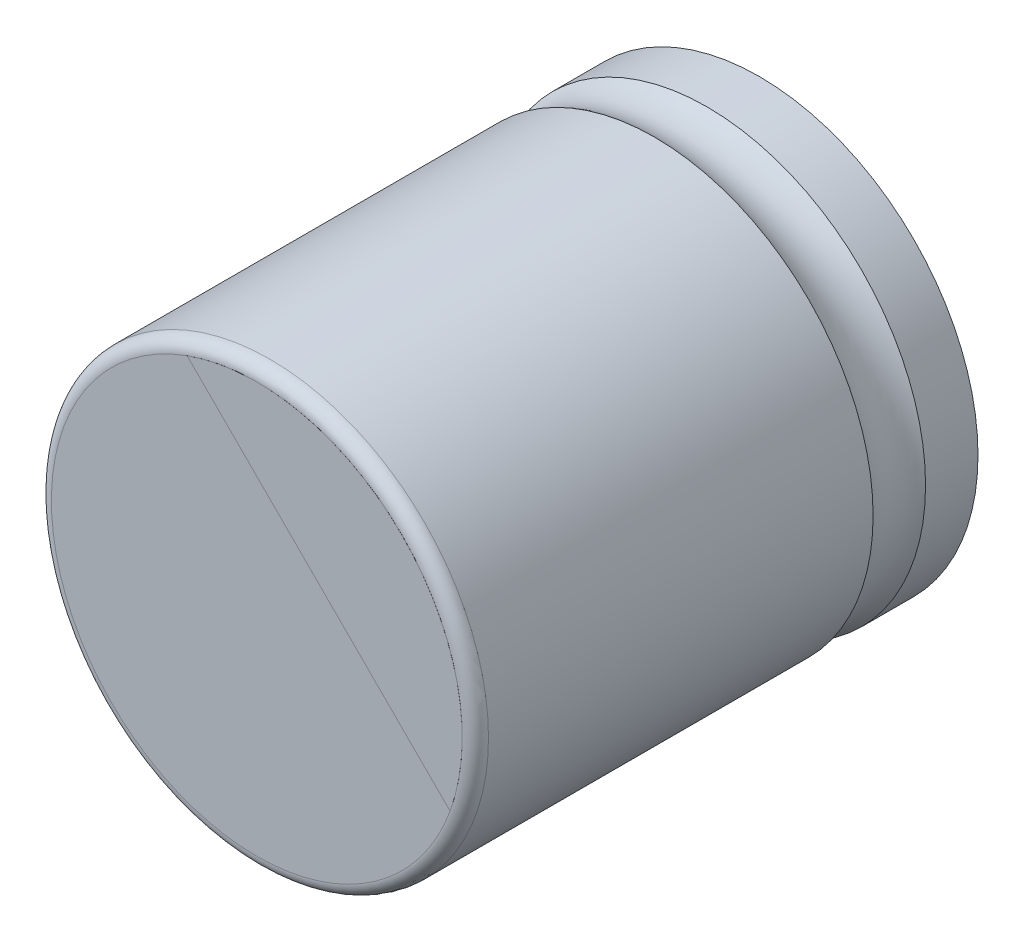
ISO-10303-21;
HEADER;
FILE_DESCRIPTION(('STEP AP214'),'2;1');
FILE_NAME('part.step','',(''),(''),'','','');
FILE_SCHEMA(('AUTOMOTIVE_DESIGN { 1 0 10303 214 1 1 1 1 }'));
ENDSEC;
DATA;
#1=APPLICATION_CONTEXT('core data for automotive mechanical design processes');
#2=APPLICATION_PROTOCOL_DEFINITION('international standard','automotive_design',2000,#1);
#3=PRODUCT_CONTEXT('',#1,'mechanical');
#4=PRODUCT('Part','Part','',(#3));
#5=PRODUCT_RELATED_PRODUCT_CATEGORY('part','',(#4));
#6=PRODUCT_DEFINITION_FORMATION('','',#4);
#7=PRODUCT_DEFINITION_CONTEXT('part definition',#1,'design');
#8=PRODUCT_DEFINITION('design','',#6,#7);
#9=PRODUCT_DEFINITION_SHAPE('','',#8);
#10=(LENGTH_UNIT() NAMED_UNIT(*) SI_UNIT(.MILLI.,.METRE.));
#11=(NAMED_UNIT(*) PLANE_ANGLE_UNIT() SI_UNIT($,.RADIAN.));
#12=(NAMED_UNIT(*) SI_UNIT($,.STERADIAN.) SOLID_ANGLE_UNIT());
#13=UNCERTAINTY_MEASURE_WITH_UNIT(LENGTH_MEASURE(1.E-05),#10,'distance_accuracy_value','');
#14=(GEOMETRIC_REPRESENTATION_CONTEXT(3) GLOBAL_UNCERTAINTY_ASSIGNED_CONTEXT((#13)) GLOBAL_UNIT_ASSIGNED_CONTEXT((#10,
#11,#12)) REPRESENTATION_CONTEXT('',''));
#15=CARTESIAN_POINT('',(0.,0.,0.));
#16=DIRECTION('',(0.,0.,1.));
#17=DIRECTION('',(1.,0.,0.));
#18=AXIS2_PLACEMENT_3D('',#15,#16,#17);
#19=CARTESIAN_POINT('',(24.106696154948,-10.7785186965825,3.050316059209));
#20=DIRECTION('',(-3.09086341954809E-08,3.09086346086632E-08,-1.));
#21=DIRECTION('',(-0.707106781186547,0.707106781186547,4.37114099658419E-08));
#22=AXIS2_PLACEMENT_3D('',#19,#20,#21);
#23=PLANE('',#22);
#24=CARTESIAN_POINT('',(24.106696154948,-10.7785186965825,3.050316059209));
#25=DIRECTION('',(-3.09086341954809E-08,3.09086346086632E-08,-1.));
#26=DIRECTION('',(0.707106781186548,0.707106781186548,0.));
#27=AXIS2_PLACEMENT_3D('',#24,#25,#26);
#28=CIRCLE('',#27,5.);
#29=CARTESIAN_POINT('',(27.6422300608807,-7.24298479064976,3.050316059209));
#30=VERTEX_POINT('',#29);
#31=EDGE_CURVE('E11',#30,#30,#28,.T.);
#32=ORIENTED_EDGE('',*,*,#31,.T.);
#33=EDGE_LOOP('',(#32));
#34=FACE_BOUND('',#33,.T.);
#35=ADVANCED_FACE('F17',(#34),#23,.T.);
#36=CARTESIAN_POINT('',(24.1066963388543,-10.7785188804889,9.000316059209));
#37=DIRECTION('',(-3.09086341954809E-08,3.09086346086632E-08,-1.));
#38=DIRECTION('',(0.707106781186548,0.707106781186548,0.));
#39=AXIS2_PLACEMENT_3D('',#36,#37,#38);
#40=CYLINDRICAL_SURFACE('',#39,5.);
#41=ORIENTED_EDGE('',*,*,#31,.F.);
#42=EDGE_LOOP('',(#41));
#43=FACE_BOUND('',#42,.T.);
#44=CARTESIAN_POINT('',(24.1066961920383,-10.7785187336728,4.25031605920913));
#45=DIRECTION('',(-3.09086341954809E-08,3.09086346086632E-08,-1.));
#46=DIRECTION('',(-0.707106781186548,-0.707106781186548,0.));
#47=AXIS2_PLACEMENT_3D('',#44,#45,#46);
#48=CIRCLE('',#47,5.);
#49=CARTESIAN_POINT('',(20.5711622861056,-14.3140526396056,4.25031605920912));
#50=VERTEX_POINT('',#49);
#51=EDGE_CURVE('E27',#50,#50,#48,.T.);
#52=ORIENTED_EDGE('',*,*,#51,.T.);
#53=EDGE_LOOP('',(#52));
#54=FACE_BOUND('',#53,.T.);
#55=ADVANCED_FACE('F107',(#43,#54),#40,.T.);
#56=CARTESIAN_POINT('',(24.1066962105835,-10.778518752218,4.850316059209));
#57=DIRECTION('',(-3.09086341954809E-08,3.09086346086632E-08,-1.));
#58=DIRECTION('',(-0.707106781186547,0.707106781186547,4.37114099658419E-08));
#59=AXIS2_PLACEMENT_3D('',#56,#57,#58);
#60=TOROIDAL_SURFACE('',#59,5.941071428571,1.116071428571);
#61=CARTESIAN_POINT('',(24.1066962291287,-10.7785187707632,5.450316059209));
#62=DIRECTION('',(-3.09086341954809E-08,3.09086346086632E-08,-1.));
#63=DIRECTION('',(0.707106781186548,0.707106781186548,0.));
#64=AXIS2_PLACEMENT_3D('',#61,#62,#63);
#65=CIRCLE('',#64,5.);
#66=CARTESIAN_POINT('',(27.6422301350614,-7.24298486483046,5.450316059209));
#67=VERTEX_POINT('',#66);
#68=EDGE_CURVE('E84',#67,#67,#65,.T.);
#69=ORIENTED_EDGE('',*,*,#68,.T.);
#70=EDGE_LOOP('',(#69));
#71=FACE_BOUND('',#70,.T.);
#72=ORIENTED_EDGE('',*,*,#51,.F.);
#73=EDGE_LOOP('',(#72));
#74=FACE_BOUND('',#73,.T.);
#75=ADVANCED_FACE('F113',(#71,#74),#60,.F.);
#76=ORIENTED_EDGE('',*,*,#68,.F.);
#77=EDGE_LOOP('',(#76));
#78=FACE_BOUND('',#77,.T.);
#79=CARTESIAN_POINT('',(24.1066965011246,-10.7785190427592,14.250316059209));
#80=DIRECTION('',(3.09086342045479E-08,-3.09086345995963E-08,1.));
#81=DIRECTION('',(0.,-1.,-3.09086345995963E-08));
#82=AXIS2_PLACEMENT_3D('',#79,#80,#81);
#83=CIRCLE('',#82,5.);
#84=CARTESIAN_POINT('',(24.1066965011246,-15.7785190427592,14.2503159046658));
#85=VERTEX_POINT('',#84);
#86=EDGE_CURVE('E61',#85,#85,#83,.T.);
#87=ORIENTED_EDGE('',*,*,#86,.F.);
#88=EDGE_LOOP('',(#87));
#89=FACE_BOUND('',#88,.T.);
#90=ADVANCED_FACE('F116',(#78,#89),#40,.T.);
#91=CARTESIAN_POINT('',(24.1066965011246,-10.7785190427592,14.250316059209));
#92=DIRECTION('',(3.09086342045479E-08,-3.09086345995963E-08,1.));
#93=DIRECTION('',(0.,-1.,-3.09086345995963E-08));
#94=AXIS2_PLACEMENT_3D('',#91,#92,#93);
#95=TOROIDAL_SURFACE('',#94,4.7,0.3);
#96=ORIENTED_EDGE('',*,*,#86,.T.);
#97=EDGE_LOOP('',(#96));
#98=FACE_BOUND('',#97,.T.);
#99=CARTESIAN_POINT('',(24.1066965103972,-10.7785190520318,14.550316059209));
#100=DIRECTION('',(-3.09086342045479E-08,3.09086345995963E-08,-1.));
#101=DIRECTION('',(0.,1.,3.09086345995963E-08));
#102=AXIS2_PLACEMENT_3D('',#99,#100,#101);
#103=CIRCLE('',#102,4.7);
#104=CARTESIAN_POINT('',(22.5134194244054,-6.35681484129442,14.5503162451238));
#105=VERTEX_POINT('',#104);
#106=CARTESIAN_POINT('',(28.5284007211348,-12.3717961380231,14.5503158732941));
#107=VERTEX_POINT('',#106);
#108=EDGE_CURVE('E57',#105,#107,#103,.T.);
#109=ORIENTED_EDGE('',*,*,#108,.T.);
#110=CARTESIAN_POINT('',(24.1066965103972,-10.7785190520318,14.550316059209));
#111=DIRECTION('',(3.09086342045479E-08,-3.09086345995963E-08,1.));
#112=DIRECTION('',(0.,-1.,-3.09086345995963E-08));
#113=AXIS2_PLACEMENT_3D('',#110,#111,#112);
#114=CIRCLE('',#113,4.7);
#115=EDGE_CURVE('E54',#107,#105,#114,.F.);
#116=ORIENTED_EDGE('',*,*,#115,.T.);
#117=EDGE_LOOP('',(#109,#116));
#118=FACE_BOUND('',#117,.T.);
#119=ADVANCED_FACE('F19',(#98,#118),#95,.T.);
#120=CARTESIAN_POINT('',(26.1230333239454,-8.7621822384836,14.550316059209));
#121=DIRECTION('',(3.09086342045479E-08,-3.09086345995963E-08,1.));
#122=DIRECTION('',(0.707106781186547,-0.707106781186547,-4.37114099658419E-08));
#123=AXIS2_PLACEMENT_3D('',#120,#121,#122);
#124=PLANE('',#123);
#125=DIRECTION('',(-0.707106781186547,0.707106781186547,4.37114099658419E-08));
#126=VECTOR('',#125,1.);
#127=CARTESIAN_POINT('',(22.5134194244061,-6.35681484129442,14.5503162451238));
#128=LINE('',#127,#126);
#129=EDGE_CURVE('E63',#107,#105,#128,.T.);
#130=ORIENTED_EDGE('',*,*,#129,.T.);
#131=ORIENTED_EDGE('',*,*,#115,.F.);
#132=EDGE_LOOP('',(#130,#131));
#133=FACE_BOUND('',#132,.T.);
#134=ADVANCED_FACE('F64',(#133),#124,.T.);
#135=CARTESIAN_POINT('',(26.1230333239764,-8.7621822385145,14.551316059209));
#136=DIRECTION('',(3.09086342045479E-08,-3.09086345995963E-08,1.));
#137=DIRECTION('',(0.707106781186547,-0.707106781186547,-4.37114099658419E-08));
#138=AXIS2_PLACEMENT_3D('',#135,#136,#137);
#139=PLANE('',#138);
#140=DIRECTION('',(0.707106781186547,-0.707106781186547,-4.37114099658419E-08));
#141=VECTOR('',#140,1.);
#142=CARTESIAN_POINT('',(25.5209100728013,-9.36430548968959,14.551316059209));
#143=LINE('',#142,#141);
#144=CARTESIAN_POINT('',(22.513419424437,-6.35681484132533,14.5513162451238));
#145=VERTEX_POINT('',#144);
#146=CARTESIAN_POINT('',(28.5284007211655,-12.3717961380539,14.5513158732941));
#147=VERTEX_POINT('',#146);
#148=EDGE_CURVE('E38',#145,#147,#143,.T.);
#149=ORIENTED_EDGE('',*,*,#148,.T.);
#150=CARTESIAN_POINT('',(24.1066965104282,-10.7785190520627,14.551316059209));
#151=DIRECTION('',(3.09086342045479E-08,-3.09086345995963E-08,1.));
#152=DIRECTION('',(0.,-1.,-3.09086345995963E-08));
#153=AXIS2_PLACEMENT_3D('',#150,#151,#152);
#154=CIRCLE('',#153,4.7);
#155=EDGE_CURVE('E21',#147,#145,#154,.T.);
#156=ORIENTED_EDGE('',*,*,#155,.T.);
#157=EDGE_LOOP('',(#149,#156));
#158=FACE_BOUND('',#157,.T.);
#159=ADVANCED_FACE('F97',(#158),#139,.T.);
#160=CARTESIAN_POINT('',(22.5134193625889,-6.35681477947715,12.5503162451239));
#161=DIRECTION('',(-0.707106781186548,-0.707106781186548,0.));
#162=DIRECTION('',(0.707106781186547,-0.707106781186547,-4.37114099658419E-08));
#163=AXIS2_PLACEMENT_3D('',#160,#161,#162);
#164=PLANE('',#163);
#165=ORIENTED_EDGE('',*,*,#129,.F.);
#166=DIRECTION('',(3.09086344020721E-08,-3.09086344020721E-08,1.));
#167=VECTOR('',#166,1.);
#168=CARTESIAN_POINT('',(28.5284006593173,-12.3717960762057,12.5503158732941));
#169=LINE('',#168,#167);
#170=EDGE_CURVE('E67',#107,#147,#169,.T.);
#171=ORIENTED_EDGE('',*,*,#170,.T.);
#172=ORIENTED_EDGE('',*,*,#148,.F.);
#173=DIRECTION('',(3.09086344020721E-08,-3.09086344020721E-08,1.));
#174=VECTOR('',#173,1.);
#175=CARTESIAN_POINT('',(22.5134193625889,-6.35681477947715,12.5503162451239));
#176=LINE('',#175,#174);
#177=EDGE_CURVE('E70',#105,#145,#176,.T.);
#178=ORIENTED_EDGE('',*,*,#177,.F.);
#179=EDGE_LOOP('',(#165,#171,#172,#178));
#180=FACE_BOUND('',#179,.T.);
#181=ADVANCED_FACE('F71',(#180),#164,.T.);
#182=CARTESIAN_POINT('',(24.10669644858,-10.7785189902145,12.550316059209));
#183=DIRECTION('',(3.09086344020721E-08,-3.09086344020721E-08,1.));
#184=DIRECTION('',(0.707106781186548,0.707106781186548,0.));
#185=AXIS2_PLACEMENT_3D('',#182,#183,#184);
#186=CYLINDRICAL_SURFACE('',#185,4.7);
#187=ORIENTED_EDGE('',*,*,#108,.F.);
#188=ORIENTED_EDGE('',*,*,#177,.T.);
#189=ORIENTED_EDGE('',*,*,#155,.F.);
#190=ORIENTED_EDGE('',*,*,#170,.F.);
#191=EDGE_LOOP('',(#187,#188,#189,#190));
#192=FACE_BOUND('',#191,.T.);
#193=ADVANCED_FACE('F76',(#192),#186,.T.);
#194=CLOSED_SHELL('',(#35,#55,#75,#90,#119,#134,#159,#181,#193));
#195=MANIFOLD_SOLID_BREP('B1',#194);
#196=ADVANCED_BREP_SHAPE_REPRESENTATION('',(#18,#195),#14);
#197=SHAPE_DEFINITION_REPRESENTATION(#9,#196);
ENDSEC;
END-ISO-10303-21;
